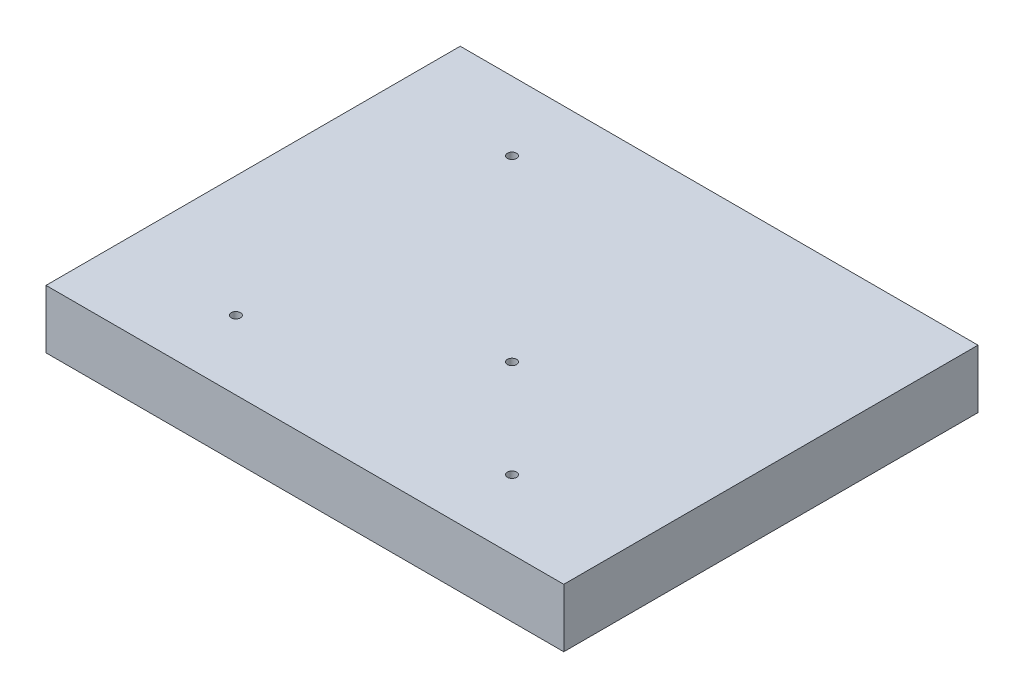
ISO-10303-21;
HEADER;
FILE_DESCRIPTION(('STEP AP214'),'2;1');
FILE_NAME('part.step','',(''),(''),'','','');
FILE_SCHEMA(('AUTOMOTIVE_DESIGN { 1 0 10303 214 1 1 1 1 }'));
ENDSEC;
DATA;
#1=APPLICATION_CONTEXT('core data for automotive mechanical design processes');
#2=APPLICATION_PROTOCOL_DEFINITION('international standard','automotive_design',2000,#1);
#3=PRODUCT_CONTEXT('',#1,'mechanical');
#4=PRODUCT('Part','Part','',(#3));
#5=PRODUCT_RELATED_PRODUCT_CATEGORY('part','',(#4));
#6=PRODUCT_DEFINITION_FORMATION('','',#4);
#7=PRODUCT_DEFINITION_CONTEXT('part definition',#1,'design');
#8=PRODUCT_DEFINITION('design','',#6,#7);
#9=PRODUCT_DEFINITION_SHAPE('','',#8);
#10=(LENGTH_UNIT() NAMED_UNIT(*) SI_UNIT(.MILLI.,.METRE.));
#11=(NAMED_UNIT(*) PLANE_ANGLE_UNIT() SI_UNIT($,.RADIAN.));
#12=(NAMED_UNIT(*) SI_UNIT($,.STERADIAN.) SOLID_ANGLE_UNIT());
#13=UNCERTAINTY_MEASURE_WITH_UNIT(LENGTH_MEASURE(1.E-05),#10,'distance_accuracy_value','');
#14=(GEOMETRIC_REPRESENTATION_CONTEXT(3) GLOBAL_UNCERTAINTY_ASSIGNED_CONTEXT((#13)) GLOBAL_UNIT_ASSIGNED_CONTEXT((#10,
#11,#12)) REPRESENTATION_CONTEXT('',''));
#15=CARTESIAN_POINT('',(0.,0.,0.));
#16=DIRECTION('',(0.,0.,1.));
#17=DIRECTION('',(1.,0.,0.));
#18=AXIS2_PLACEMENT_3D('',#15,#16,#17);
#19=CARTESIAN_POINT('',(0.,0.,0.));
#20=DIRECTION('',(0.,1.,0.));
#21=DIRECTION('',(0.,0.,1.));
#22=AXIS2_PLACEMENT_3D('',#19,#20,#21);
#23=PLANE('',#22);
#24=CARTESIAN_POINT('',(-30.,0.,30.));
#25=DIRECTION('',(0.,1.,0.));
#26=DIRECTION('',(0.,0.,1.));
#27=AXIS2_PLACEMENT_3D('',#24,#25,#26);
#28=CIRCLE('',#27,0.999999999999998);
#29=CARTESIAN_POINT('',(-30.,0.,31.));
#30=VERTEX_POINT('',#29);
#31=EDGE_CURVE('E120',#30,#30,#28,.T.);
#32=ORIENTED_EDGE('',*,*,#31,.T.);
#33=EDGE_LOOP('',(#32));
#34=FACE_BOUND('',#33,.T.);
#35=CARTESIAN_POINT('',(-30.,0.,-30.));
#36=DIRECTION('',(0.,1.,0.));
#37=DIRECTION('',(0.,0.,1.));
#38=AXIS2_PLACEMENT_3D('',#35,#36,#37);
#39=CIRCLE('',#38,0.999999999999998);
#40=CARTESIAN_POINT('',(-30.,0.,-29.));
#41=VERTEX_POINT('',#40);
#42=EDGE_CURVE('E108',#41,#41,#39,.T.);
#43=ORIENTED_EDGE('',*,*,#42,.T.);
#44=EDGE_LOOP('',(#43));
#45=FACE_BOUND('',#44,.T.);
#46=DIRECTION('',(0.,0.,1.));
#47=VECTOR('',#46,1.);
#48=CARTESIAN_POINT('',(-56.25,0.,45.));
#49=LINE('',#48,#47);
#50=CARTESIAN_POINT('',(-56.25,0.,-45.));
#51=VERTEX_POINT('',#50);
#52=CARTESIAN_POINT('',(-56.25,0.,45.));
#53=VERTEX_POINT('',#52);
#54=EDGE_CURVE('E82',#51,#53,#49,.T.);
#55=ORIENTED_EDGE('',*,*,#54,.F.);
#56=DIRECTION('',(-1.,0.,0.));
#57=VECTOR('',#56,1.);
#58=CARTESIAN_POINT('',(56.25,0.,-45.));
#59=LINE('',#58,#57);
#60=CARTESIAN_POINT('',(56.25,0.,-45.));
#61=VERTEX_POINT('',#60);
#62=EDGE_CURVE('E88',#61,#51,#59,.T.);
#63=ORIENTED_EDGE('',*,*,#62,.F.);
#64=DIRECTION('',(0.,0.,-1.));
#65=VECTOR('',#64,1.);
#66=CARTESIAN_POINT('',(56.25,0.,45.));
#67=LINE('',#66,#65);
#68=CARTESIAN_POINT('',(56.25,0.,45.));
#69=VERTEX_POINT('',#68);
#70=EDGE_CURVE('E105',#69,#61,#67,.T.);
#71=ORIENTED_EDGE('',*,*,#70,.F.);
#72=DIRECTION('',(1.,0.,0.));
#73=VECTOR('',#72,1.);
#74=CARTESIAN_POINT('',(56.25,0.,45.));
#75=LINE('',#74,#73);
#76=EDGE_CURVE('E95',#53,#69,#75,.T.);
#77=ORIENTED_EDGE('',*,*,#76,.F.);
#78=EDGE_LOOP('',(#55,#63,#71,#77));
#79=FACE_BOUND('',#78,.T.);
#80=CARTESIAN_POINT('',(30.,0.,30.));
#81=DIRECTION('',(0.,1.,0.));
#82=DIRECTION('',(0.,0.,1.));
#83=AXIS2_PLACEMENT_3D('',#80,#81,#82);
#84=CIRCLE('',#83,0.999999999999998);
#85=CARTESIAN_POINT('',(30.,0.,31.));
#86=VERTEX_POINT('',#85);
#87=EDGE_CURVE('E114',#86,#86,#84,.T.);
#88=ORIENTED_EDGE('',*,*,#87,.T.);
#89=EDGE_LOOP('',(#88));
#90=FACE_BOUND('',#89,.T.);
#91=CARTESIAN_POINT('',(8.78679656440357,0.,8.78679656440358));
#92=DIRECTION('',(0.,1.,0.));
#93=DIRECTION('',(0.,0.,1.));
#94=AXIS2_PLACEMENT_3D('',#91,#92,#93);
#95=CIRCLE('',#94,1.);
#96=CARTESIAN_POINT('',(8.78679656440357,0.,9.78679656440358));
#97=VERTEX_POINT('',#96);
#98=EDGE_CURVE('E126',#97,#97,#95,.T.);
#99=ORIENTED_EDGE('',*,*,#98,.T.);
#100=EDGE_LOOP('',(#99));
#101=FACE_BOUND('',#100,.T.);
#102=ADVANCED_FACE('F33',(#34,#45,#79,#90,#101),#23,.F.);
#103=CARTESIAN_POINT('',(0.,12.7,0.));
#104=DIRECTION('',(0.,1.,0.));
#105=DIRECTION('',(0.,0.,1.));
#106=AXIS2_PLACEMENT_3D('',#103,#104,#105);
#107=PLANE('',#106);
#108=CARTESIAN_POINT('',(-30.,12.7,30.));
#109=DIRECTION('',(0.,1.,0.));
#110=DIRECTION('',(0.,0.,1.));
#111=AXIS2_PLACEMENT_3D('',#108,#109,#110);
#112=CIRCLE('',#111,0.999999999999998);
#113=CARTESIAN_POINT('',(-30.,12.7,31.));
#114=VERTEX_POINT('',#113);
#115=EDGE_CURVE('E117',#114,#114,#112,.T.);
#116=ORIENTED_EDGE('',*,*,#115,.F.);
#117=EDGE_LOOP('',(#116));
#118=FACE_BOUND('',#117,.T.);
#119=CARTESIAN_POINT('',(-30.,12.7,-30.));
#120=DIRECTION('',(0.,1.,0.));
#121=DIRECTION('',(0.,0.,1.));
#122=AXIS2_PLACEMENT_3D('',#119,#120,#121);
#123=CIRCLE('',#122,0.999999999999998);
#124=CARTESIAN_POINT('',(-30.,12.7,-29.));
#125=VERTEX_POINT('',#124);
#126=EDGE_CURVE('E86',#125,#125,#123,.T.);
#127=ORIENTED_EDGE('',*,*,#126,.F.);
#128=EDGE_LOOP('',(#127));
#129=FACE_BOUND('',#128,.T.);
#130=DIRECTION('',(-1.,0.,0.));
#131=VECTOR('',#130,1.);
#132=CARTESIAN_POINT('',(56.25,12.7,-45.));
#133=LINE('',#132,#131);
#134=CARTESIAN_POINT('',(56.25,12.7,-45.));
#135=VERTEX_POINT('',#134);
#136=CARTESIAN_POINT('',(-56.25,12.7,-45.));
#137=VERTEX_POINT('',#136);
#138=EDGE_CURVE('E92',#135,#137,#133,.T.);
#139=ORIENTED_EDGE('',*,*,#138,.T.);
#140=DIRECTION('',(0.,0.,1.));
#141=VECTOR('',#140,1.);
#142=CARTESIAN_POINT('',(-56.25,12.7,45.));
#143=LINE('',#142,#141);
#144=CARTESIAN_POINT('',(-56.25,12.7,45.));
#145=VERTEX_POINT('',#144);
#146=EDGE_CURVE('E84',#137,#145,#143,.T.);
#147=ORIENTED_EDGE('',*,*,#146,.T.);
#148=DIRECTION('',(1.,0.,0.));
#149=VECTOR('',#148,1.);
#150=CARTESIAN_POINT('',(56.25,12.7,45.));
#151=LINE('',#150,#149);
#152=CARTESIAN_POINT('',(56.25,12.7,45.));
#153=VERTEX_POINT('',#152);
#154=EDGE_CURVE('E42',#145,#153,#151,.T.);
#155=ORIENTED_EDGE('',*,*,#154,.T.);
#156=DIRECTION('',(0.,0.,-1.));
#157=VECTOR('',#156,1.);
#158=CARTESIAN_POINT('',(56.25,12.7,45.));
#159=LINE('',#158,#157);
#160=EDGE_CURVE('E11',#153,#135,#159,.T.);
#161=ORIENTED_EDGE('',*,*,#160,.T.);
#162=EDGE_LOOP('',(#139,#147,#155,#161));
#163=FACE_BOUND('',#162,.T.);
#164=CARTESIAN_POINT('',(30.,12.7,30.));
#165=DIRECTION('',(0.,1.,0.));
#166=DIRECTION('',(0.,0.,1.));
#167=AXIS2_PLACEMENT_3D('',#164,#165,#166);
#168=CIRCLE('',#167,0.999999999999998);
#169=CARTESIAN_POINT('',(30.,12.7,31.));
#170=VERTEX_POINT('',#169);
#171=EDGE_CURVE('E111',#170,#170,#168,.T.);
#172=ORIENTED_EDGE('',*,*,#171,.F.);
#173=EDGE_LOOP('',(#172));
#174=FACE_BOUND('',#173,.T.);
#175=CARTESIAN_POINT('',(8.78679656440357,12.7,8.78679656440358));
#176=DIRECTION('',(0.,1.,0.));
#177=DIRECTION('',(0.,0.,1.));
#178=AXIS2_PLACEMENT_3D('',#175,#176,#177);
#179=CIRCLE('',#178,1.);
#180=CARTESIAN_POINT('',(8.78679656440357,12.7,9.78679656440358));
#181=VERTEX_POINT('',#180);
#182=EDGE_CURVE('E123',#181,#181,#179,.T.);
#183=ORIENTED_EDGE('',*,*,#182,.F.);
#184=EDGE_LOOP('',(#183));
#185=FACE_BOUND('',#184,.T.);
#186=ADVANCED_FACE('F35',(#118,#129,#163,#174,#185),#107,.T.);
#187=CARTESIAN_POINT('',(-56.25,156.770295342239,45.));
#188=DIRECTION('',(1.,0.,0.));
#189=DIRECTION('',(0.,0.,-1.));
#190=AXIS2_PLACEMENT_3D('',#187,#188,#189);
#191=PLANE('',#190);
#192=ORIENTED_EDGE('',*,*,#146,.F.);
#193=DIRECTION('',(0.,-1.,0.));
#194=VECTOR('',#193,1.);
#195=CARTESIAN_POINT('',(-56.25,156.770295342239,-45.));
#196=LINE('',#195,#194);
#197=EDGE_CURVE('E37',#137,#51,#196,.T.);
#198=ORIENTED_EDGE('',*,*,#197,.T.);
#199=ORIENTED_EDGE('',*,*,#54,.T.);
#200=DIRECTION('',(0.,-1.,0.));
#201=VECTOR('',#200,1.);
#202=CARTESIAN_POINT('',(-56.25,156.770295342239,45.));
#203=LINE('',#202,#201);
#204=EDGE_CURVE('E72',#145,#53,#203,.T.);
#205=ORIENTED_EDGE('',*,*,#204,.F.);
#206=EDGE_LOOP('',(#192,#198,#199,#205));
#207=FACE_BOUND('',#206,.T.);
#208=ADVANCED_FACE('F80',(#207),#191,.F.);
#209=CARTESIAN_POINT('',(56.25,156.770295342239,45.));
#210=DIRECTION('',(0.,0.,-1.));
#211=DIRECTION('',(-1.,0.,0.));
#212=AXIS2_PLACEMENT_3D('',#209,#210,#211);
#213=PLANE('',#212);
#214=ORIENTED_EDGE('',*,*,#154,.F.);
#215=ORIENTED_EDGE('',*,*,#204,.T.);
#216=ORIENTED_EDGE('',*,*,#76,.T.);
#217=DIRECTION('',(0.,-1.,0.));
#218=VECTOR('',#217,1.);
#219=CARTESIAN_POINT('',(56.25,156.770295342239,45.));
#220=LINE('',#219,#218);
#221=EDGE_CURVE('E104',#153,#69,#220,.T.);
#222=ORIENTED_EDGE('',*,*,#221,.F.);
#223=EDGE_LOOP('',(#214,#215,#216,#222));
#224=FACE_BOUND('',#223,.T.);
#225=ADVANCED_FACE('F141',(#224),#213,.F.);
#226=CARTESIAN_POINT('',(56.25,156.770295342239,45.));
#227=DIRECTION('',(-1.,0.,0.));
#228=DIRECTION('',(0.,0.,1.));
#229=AXIS2_PLACEMENT_3D('',#226,#227,#228);
#230=PLANE('',#229);
#231=ORIENTED_EDGE('',*,*,#160,.F.);
#232=ORIENTED_EDGE('',*,*,#221,.T.);
#233=ORIENTED_EDGE('',*,*,#70,.T.);
#234=DIRECTION('',(0.,-1.,0.));
#235=VECTOR('',#234,1.);
#236=CARTESIAN_POINT('',(56.25,156.770295342239,-45.));
#237=LINE('',#236,#235);
#238=EDGE_CURVE('E55',#135,#61,#237,.T.);
#239=ORIENTED_EDGE('',*,*,#238,.F.);
#240=EDGE_LOOP('',(#231,#232,#233,#239));
#241=FACE_BOUND('',#240,.T.);
#242=ADVANCED_FACE('F173',(#241),#230,.F.);
#243=CARTESIAN_POINT('',(56.25,156.770295342239,-45.));
#244=DIRECTION('',(0.,0.,1.));
#245=DIRECTION('',(1.,0.,0.));
#246=AXIS2_PLACEMENT_3D('',#243,#244,#245);
#247=PLANE('',#246);
#248=ORIENTED_EDGE('',*,*,#138,.F.);
#249=ORIENTED_EDGE('',*,*,#238,.T.);
#250=ORIENTED_EDGE('',*,*,#62,.T.);
#251=ORIENTED_EDGE('',*,*,#197,.F.);
#252=EDGE_LOOP('',(#248,#249,#250,#251));
#253=FACE_BOUND('',#252,.T.);
#254=ADVANCED_FACE('F89',(#253),#247,.F.);
#255=CARTESIAN_POINT('',(-30.,12.7,-30.));
#256=DIRECTION('',(0.,-1.,0.));
#257=DIRECTION('',(0.,0.,-1.));
#258=AXIS2_PLACEMENT_3D('',#255,#256,#257);
#259=CYLINDRICAL_SURFACE('',#258,0.999999999999998);
#260=ORIENTED_EDGE('',*,*,#126,.T.);
#261=EDGE_LOOP('',(#260));
#262=FACE_BOUND('',#261,.T.);
#263=ORIENTED_EDGE('',*,*,#42,.F.);
#264=EDGE_LOOP('',(#263));
#265=FACE_BOUND('',#264,.T.);
#266=ADVANCED_FACE('F155',(#262,#265),#259,.F.);
#267=CARTESIAN_POINT('',(30.,12.7,30.));
#268=DIRECTION('',(0.,-1.,0.));
#269=DIRECTION('',(0.,0.,-1.));
#270=AXIS2_PLACEMENT_3D('',#267,#268,#269);
#271=CYLINDRICAL_SURFACE('',#270,0.999999999999998);
#272=ORIENTED_EDGE('',*,*,#171,.T.);
#273=EDGE_LOOP('',(#272));
#274=FACE_BOUND('',#273,.T.);
#275=ORIENTED_EDGE('',*,*,#87,.F.);
#276=EDGE_LOOP('',(#275));
#277=FACE_BOUND('',#276,.T.);
#278=ADVANCED_FACE('F151',(#274,#277),#271,.F.);
#279=CARTESIAN_POINT('',(-30.,12.7,30.));
#280=DIRECTION('',(0.,-1.,0.));
#281=DIRECTION('',(0.,0.,-1.));
#282=AXIS2_PLACEMENT_3D('',#279,#280,#281);
#283=CYLINDRICAL_SURFACE('',#282,0.999999999999998);
#284=ORIENTED_EDGE('',*,*,#115,.T.);
#285=EDGE_LOOP('',(#284));
#286=FACE_BOUND('',#285,.T.);
#287=ORIENTED_EDGE('',*,*,#31,.F.);
#288=EDGE_LOOP('',(#287));
#289=FACE_BOUND('',#288,.T.);
#290=ADVANCED_FACE('F154',(#286,#289),#283,.F.);
#291=CARTESIAN_POINT('',(8.78679656440357,12.7,8.78679656440358));
#292=DIRECTION('',(0.,-1.,0.));
#293=DIRECTION('',(0.,0.,-1.));
#294=AXIS2_PLACEMENT_3D('',#291,#292,#293);
#295=CYLINDRICAL_SURFACE('',#294,1.);
#296=ORIENTED_EDGE('',*,*,#182,.T.);
#297=EDGE_LOOP('',(#296));
#298=FACE_BOUND('',#297,.T.);
#299=ORIENTED_EDGE('',*,*,#98,.F.);
#300=EDGE_LOOP('',(#299));
#301=FACE_BOUND('',#300,.T.);
#302=ADVANCED_FACE('F132',(#298,#301),#295,.F.);
#303=CLOSED_SHELL('',(#102,#186,#208,#225,#242,#254,#266,#278,#290,#302));
#304=MANIFOLD_SOLID_BREP('B2',#303);
#305=ADVANCED_BREP_SHAPE_REPRESENTATION('',(#18,#304),#14);
#306=SHAPE_DEFINITION_REPRESENTATION(#9,#305);
ENDSEC;
END-ISO-10303-21;
